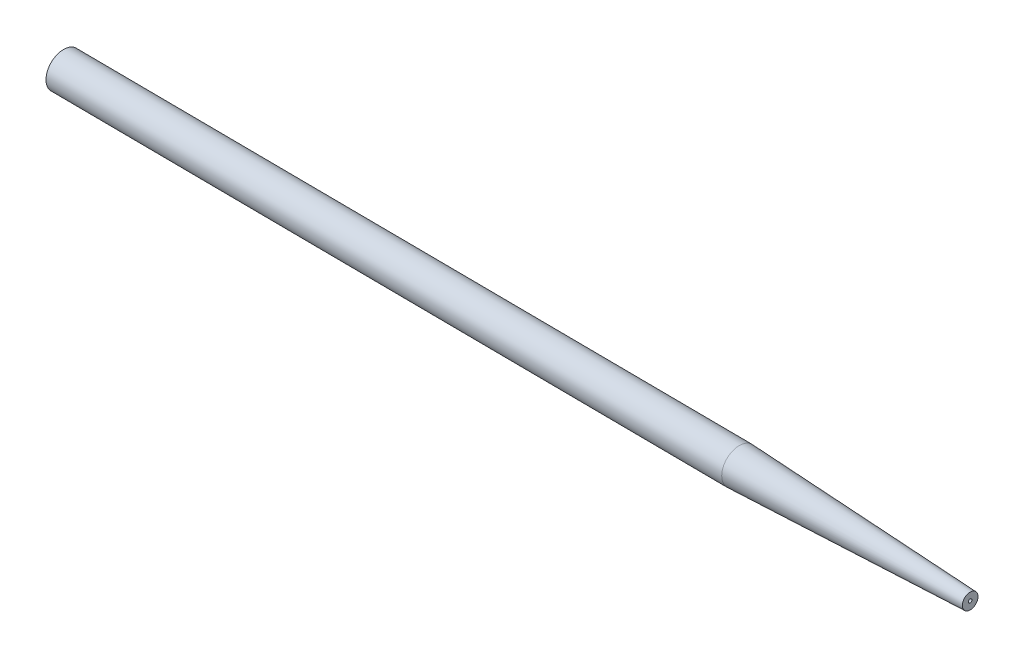
ISO-10303-21;
HEADER;
FILE_DESCRIPTION(('STEP AP214'),'2;1');
FILE_NAME('part.step','',(''),(''),'','','');
FILE_SCHEMA(('AUTOMOTIVE_DESIGN { 1 0 10303 214 1 1 1 1 }'));
ENDSEC;
DATA;
#1=APPLICATION_CONTEXT('core data for automotive mechanical design processes');
#2=APPLICATION_PROTOCOL_DEFINITION('international standard','automotive_design',2000,#1);
#3=PRODUCT_CONTEXT('',#1,'mechanical');
#4=PRODUCT('Part','Part','',(#3));
#5=PRODUCT_RELATED_PRODUCT_CATEGORY('part','',(#4));
#6=PRODUCT_DEFINITION_FORMATION('','',#4);
#7=PRODUCT_DEFINITION_CONTEXT('part definition',#1,'design');
#8=PRODUCT_DEFINITION('design','',#6,#7);
#9=PRODUCT_DEFINITION_SHAPE('','',#8);
#10=(LENGTH_UNIT() NAMED_UNIT(*) SI_UNIT(.MILLI.,.METRE.));
#11=(NAMED_UNIT(*) PLANE_ANGLE_UNIT() SI_UNIT($,.RADIAN.));
#12=(NAMED_UNIT(*) SI_UNIT($,.STERADIAN.) SOLID_ANGLE_UNIT());
#13=UNCERTAINTY_MEASURE_WITH_UNIT(LENGTH_MEASURE(1.E-05),#10,'distance_accuracy_value','');
#14=(GEOMETRIC_REPRESENTATION_CONTEXT(3) GLOBAL_UNCERTAINTY_ASSIGNED_CONTEXT((#13)) GLOBAL_UNIT_ASSIGNED_CONTEXT((#10,
#11,#12)) REPRESENTATION_CONTEXT('',''));
#15=CARTESIAN_POINT('',(0.,0.,0.));
#16=DIRECTION('',(0.,0.,1.));
#17=DIRECTION('',(1.,0.,0.));
#18=AXIS2_PLACEMENT_3D('',#15,#16,#17);
#19=CARTESIAN_POINT('',(11.5195881915145,0.,-76.6076569711961));
#20=DIRECTION('',(0.99997097682569,0.,0.00761876015346572));
#21=DIRECTION('',(0.00761876015346572,0.,-0.99997097682569));
#22=AXIS2_PLACEMENT_3D('',#19,#20,#21);
#23=CONICAL_SURFACE('',#22,0.,1.56317749293371);
#24=CARTESIAN_POINT('',(11.5386345390966,0.,-76.6075118574304));
#25=DIRECTION('',(-0.99997097682569,0.,-0.00761876015346572));
#26=DIRECTION('',(-0.00761876015346572,0.,0.99997097682569));
#27=AXIS2_PLACEMENT_3D('',#24,#25,#26);
#28=CIRCLE('',#27,2.49992744206423);
#29=CARTESIAN_POINT('',(11.5195881915145,0.,-74.1076569711961));
#30=VERTEX_POINT('',#29);
#31=EDGE_CURVE('E63',#30,#30,#28,.T.);
#32=ORIENTED_EDGE('',*,*,#31,.T.);
#33=EDGE_LOOP('',(#32));
#34=FACE_BOUND('',#33,.T.);
#35=CARTESIAN_POINT('',(11.5195881915145,0.,-76.6076569711961));
#36=VERTEX_POINT('',#35);
#37=VERTEX_LOOP('',#36);
#38=FACE_BOUND('',#37,.T.);
#39=ADVANCED_FACE('F35',(#34,#38),#23,.T.);
#40=CARTESIAN_POINT('',(141.38276432706,0.,-75.6182318631948));
#41=DIRECTION('',(0.99997097682569,0.,0.00761876015346572));
#42=DIRECTION('',(0.00761876015346572,0.,-0.99997097682569));
#43=AXIS2_PLACEMENT_3D('',#40,#41,#42);
#44=CONICAL_SURFACE('',#43,0.256576457612368,0.00775841381220047);
#45=CARTESIAN_POINT('',(108.313651328713,0.,-75.8701848160915));
#46=VERTEX_POINT('',#45);
#47=VERTEX_LOOP('',#46);
#48=FACE_BOUND('',#47,.T.);
#49=CARTESIAN_POINT('',(141.38276432706,0.,-75.6182318631948));
#50=DIRECTION('',(-0.99997097682569,0.,-0.00761876015346572));
#51=DIRECTION('',(-0.00761876015346572,0.,0.99997097682569));
#52=AXIS2_PLACEMENT_3D('',#49,#50,#51);
#53=CIRCLE('',#52,0.256576457612372);
#54=CARTESIAN_POINT('',(141.380809532568,0.,-75.3616628522456));
#55=VERTEX_POINT('',#54);
#56=EDGE_CURVE('E11',#55,#55,#53,.T.);
#57=ORIENTED_EDGE('',*,*,#56,.F.);
#58=EDGE_LOOP('',(#57));
#59=FACE_BOUND('',#58,.T.);
#60=ADVANCED_FACE('F48',(#48,#59),#44,.F.);
#61=CARTESIAN_POINT('',(141.389214536938,0.,-75.6181827191664));
#62=DIRECTION('',(0.99997097682569,0.,0.00761876015346572));
#63=DIRECTION('',(0.00761876015346572,0.,-0.99997097682569));
#64=AXIS2_PLACEMENT_3D('',#61,#62,#63);
#65=CONICAL_SURFACE('',#64,1.10319844710322,1.56317749293371);
#66=ORIENTED_EDGE('',*,*,#56,.T.);
#67=EDGE_LOOP('',(#66));
#68=FACE_BOUND('',#67,.T.);
#69=CARTESIAN_POINT('',(141.389214536938,0.,-75.6181827191664));
#70=DIRECTION('',(-0.99997097682569,0.,-0.00761876015346572));
#71=DIRECTION('',(-0.00761876015346572,0.,0.99997097682569));
#72=AXIS2_PLACEMENT_3D('',#69,#70,#71);
#73=CIRCLE('',#72,1.10319844710322);
#74=CARTESIAN_POINT('',(141.380809532568,0.,-74.515016290384));
#75=VERTEX_POINT('',#74);
#76=EDGE_CURVE('E42',#75,#75,#73,.T.);
#77=ORIENTED_EDGE('',*,*,#76,.F.);
#78=EDGE_LOOP('',(#77));
#79=FACE_BOUND('',#78,.T.);
#80=ADVANCED_FACE('F51',(#68,#79),#65,.F.);
#81=CARTESIAN_POINT('',(140.544307862249,0.,-75.6246200473046));
#82=DIRECTION('',(-0.99997097682569,0.,-0.00761876015346572));
#83=DIRECTION('',(-0.00761876015346572,0.,0.99997097682569));
#84=AXIS2_PLACEMENT_3D('',#81,#82,#83);
#85=TOROIDAL_SURFACE('',#84,373.002474714786,371.900236081068);
#86=ORIENTED_EDGE('',*,*,#76,.T.);
#87=EDGE_LOOP('',(#86));
#88=FACE_BOUND('',#87,.T.);
#89=CARTESIAN_POINT('',(108.332697676295,0.,-75.8700397023258));
#90=DIRECTION('',(-0.99997097682569,0.,-0.00761876015346572));
#91=DIRECTION('',(-0.00761876015346572,0.,0.99997097682569));
#92=AXIS2_PLACEMENT_3D('',#89,#90,#91);
#93=CIRCLE('',#92,2.49992744206423);
#94=CARTESIAN_POINT('',(108.313651328713,0.,-73.3701848160915));
#95=VERTEX_POINT('',#94);
#96=EDGE_CURVE('E61',#95,#95,#93,.T.);
#97=ORIENTED_EDGE('',*,*,#96,.F.);
#98=EDGE_LOOP('',(#97));
#99=FACE_BOUND('',#98,.T.);
#100=ADVANCED_FACE('F56',(#88,#99),#85,.F.);
#101=CARTESIAN_POINT('',(11.5195881915145,0.,-76.6076569711961));
#102=DIRECTION('',(-0.99997097682569,0.,-0.00761876015346572));
#103=DIRECTION('',(-0.00761876015346572,0.,0.99997097682569));
#104=AXIS2_PLACEMENT_3D('',#101,#102,#103);
#105=CYLINDRICAL_SURFACE('',#104,2.49992744206423);
#106=ORIENTED_EDGE('',*,*,#96,.T.);
#107=EDGE_LOOP('',(#106));
#108=FACE_BOUND('',#107,.T.);
#109=ORIENTED_EDGE('',*,*,#31,.F.);
#110=EDGE_LOOP('',(#109));
#111=FACE_BOUND('',#110,.T.);
#112=ADVANCED_FACE('F70',(#108,#111),#105,.T.);
#113=CLOSED_SHELL('',(#39,#60,#80,#100,#112));
#114=MANIFOLD_SOLID_BREP('B2',#113);
#115=ADVANCED_BREP_SHAPE_REPRESENTATION('',(#18,#114),#14);
#116=SHAPE_DEFINITION_REPRESENTATION(#9,#115);
ENDSEC;
END-ISO-10303-21;
